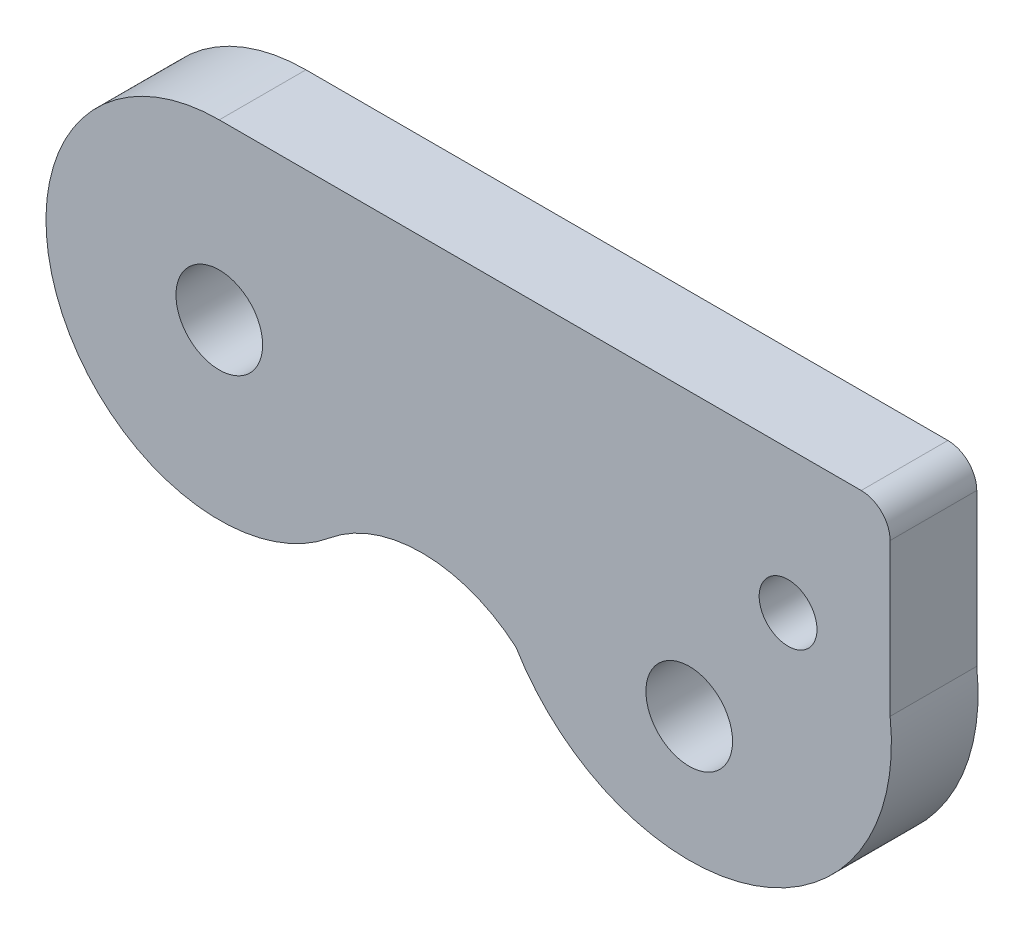
ISO-10303-21;
HEADER;
FILE_DESCRIPTION(('STEP AP214'),'2;1');
FILE_NAME('part.step','',(''),(''),'','','');
FILE_SCHEMA(('AUTOMOTIVE_DESIGN { 1 0 10303 214 1 1 1 1 }'));
ENDSEC;
DATA;
#1=APPLICATION_CONTEXT('core data for automotive mechanical design processes');
#2=APPLICATION_PROTOCOL_DEFINITION('international standard','automotive_design',2000,#1);
#3=PRODUCT_CONTEXT('',#1,'mechanical');
#4=PRODUCT('Part','Part','',(#3));
#5=PRODUCT_RELATED_PRODUCT_CATEGORY('part','',(#4));
#6=PRODUCT_DEFINITION_FORMATION('','',#4);
#7=PRODUCT_DEFINITION_CONTEXT('part definition',#1,'design');
#8=PRODUCT_DEFINITION('design','',#6,#7);
#9=PRODUCT_DEFINITION_SHAPE('','',#8);
#10=(LENGTH_UNIT() NAMED_UNIT(*) SI_UNIT(.MILLI.,.METRE.));
#11=(NAMED_UNIT(*) PLANE_ANGLE_UNIT() SI_UNIT($,.RADIAN.));
#12=(NAMED_UNIT(*) SI_UNIT($,.STERADIAN.) SOLID_ANGLE_UNIT());
#13=UNCERTAINTY_MEASURE_WITH_UNIT(LENGTH_MEASURE(1.E-05),#10,'distance_accuracy_value','');
#14=(GEOMETRIC_REPRESENTATION_CONTEXT(3) GLOBAL_UNCERTAINTY_ASSIGNED_CONTEXT((#13)) GLOBAL_UNIT_ASSIGNED_CONTEXT((#10,
#11,#12)) REPRESENTATION_CONTEXT('',''));
#15=CARTESIAN_POINT('',(0.,0.,0.));
#16=DIRECTION('',(0.,0.,1.));
#17=DIRECTION('',(1.,0.,0.));
#18=AXIS2_PLACEMENT_3D('',#15,#16,#17);
#19=CARTESIAN_POINT('',(0.,-6.,3.));
#20=DIRECTION('',(0.,0.,1.));
#21=DIRECTION('',(1.,0.,0.));
#22=AXIS2_PLACEMENT_3D('',#19,#20,#21);
#23=PLANE('',#22);
#24=CARTESIAN_POINT('',(19.6906458159987,-4.93616233806258,3.));
#25=DIRECTION('',(0.,0.,1.));
#26=DIRECTION('',(1.,0.,0.));
#27=AXIS2_PLACEMENT_3D('',#24,#25,#26);
#28=CIRCLE('',#27,0.999999999999994);
#29=CARTESIAN_POINT('',(20.6906458159987,-4.93616233806258,3.));
#30=VERTEX_POINT('',#29);
#31=EDGE_CURVE('E150',#30,#30,#28,.T.);
#32=ORIENTED_EDGE('',*,*,#31,.F.);
#33=EDGE_LOOP('',(#32));
#34=FACE_BOUND('',#33,.T.);
#35=CARTESIAN_POINT('',(0.,-6.,3.));
#36=DIRECTION('',(0.,0.,1.));
#37=DIRECTION('',(1.,0.,0.));
#38=AXIS2_PLACEMENT_3D('',#35,#36,#37);
#39=CIRCLE('',#38,6.);
#40=CARTESIAN_POINT('',(0.,0.,3.));
#41=VERTEX_POINT('',#40);
#42=CARTESIAN_POINT('',(3.82727225710111,-10.6208210385195,3.));
#43=VERTEX_POINT('',#42);
#44=EDGE_CURVE('E131',#41,#43,#39,.T.);
#45=ORIENTED_EDGE('',*,*,#44,.T.);
#46=CARTESIAN_POINT('',(7.01666580468537,-14.4715052372857,3.));
#47=DIRECTION('',(0.,0.,-1.));
#48=DIRECTION('',(-1.,0.,0.));
#49=AXIS2_PLACEMENT_3D('',#46,#47,#48);
#50=CIRCLE('',#49,5.);
#51=CARTESIAN_POINT('',(10.269229399763,-10.6740284355164,3.));
#52=VERTEX_POINT('',#51);
#53=EDGE_CURVE('E85',#43,#52,#50,.T.);
#54=ORIENTED_EDGE('',*,*,#53,.T.);
#55=CARTESIAN_POINT('',(16.2687627712159,-7.06770075700153,3.));
#56=DIRECTION('',(0.,0.,1.));
#57=DIRECTION('',(1.,0.,0.));
#58=AXIS2_PLACEMENT_3D('',#55,#56,#57);
#59=CIRCLE('',#58,7.);
#60=CARTESIAN_POINT('',(23.2233881055421,-6.2719706148369,3.));
#61=VERTEX_POINT('',#60);
#62=EDGE_CURVE('E99',#52,#61,#59,.T.);
#63=ORIENTED_EDGE('',*,*,#62,.T.);
#64=DIRECTION('',(0.,1.,0.));
#65=VECTOR('',#64,1.);
#66=CARTESIAN_POINT('',(23.2233881055421,-6.2719706148369,3.));
#67=LINE('',#66,#65);
#68=CARTESIAN_POINT('',(23.2233881055421,-1.,3.));
#69=VERTEX_POINT('',#68);
#70=EDGE_CURVE('E92',#61,#69,#67,.T.);
#71=ORIENTED_EDGE('',*,*,#70,.T.);
#72=CARTESIAN_POINT('',(22.2233881055421,-1.,3.));
#73=DIRECTION('',(0.,0.,1.));
#74=DIRECTION('',(1.,0.,0.));
#75=AXIS2_PLACEMENT_3D('',#72,#73,#74);
#76=CIRCLE('',#75,1.);
#77=CARTESIAN_POINT('',(22.2233881055421,0.,3.));
#78=VERTEX_POINT('',#77);
#79=EDGE_CURVE('E96',#69,#78,#76,.T.);
#80=ORIENTED_EDGE('',*,*,#79,.T.);
#81=DIRECTION('',(-1.,0.,0.));
#82=VECTOR('',#81,1.);
#83=CARTESIAN_POINT('',(22.,0.,3.));
#84=LINE('',#83,#82);
#85=EDGE_CURVE('E50',#78,#41,#84,.T.);
#86=ORIENTED_EDGE('',*,*,#85,.T.);
#87=EDGE_LOOP('',(#45,#54,#63,#71,#80,#86));
#88=FACE_BOUND('',#87,.T.);
#89=CARTESIAN_POINT('',(0.,-6.,3.));
#90=DIRECTION('',(0.,0.,1.));
#91=DIRECTION('',(1.,0.,0.));
#92=AXIS2_PLACEMENT_3D('',#89,#90,#91);
#93=CIRCLE('',#92,1.5);
#94=CARTESIAN_POINT('',(1.5,-6.,3.));
#95=VERTEX_POINT('',#94);
#96=EDGE_CURVE('E123',#95,#95,#93,.T.);
#97=ORIENTED_EDGE('',*,*,#96,.F.);
#98=EDGE_LOOP('',(#97));
#99=FACE_BOUND('',#98,.T.);
#100=CARTESIAN_POINT('',(16.2687627712159,-9.74796623904576,3.));
#101=DIRECTION('',(0.,0.,1.));
#102=DIRECTION('',(1.,0.,0.));
#103=AXIS2_PLACEMENT_3D('',#100,#101,#102);
#104=CIRCLE('',#103,1.5);
#105=CARTESIAN_POINT('',(17.7687627712159,-9.74796623904576,3.));
#106=VERTEX_POINT('',#105);
#107=EDGE_CURVE('E156',#106,#106,#104,.T.);
#108=ORIENTED_EDGE('',*,*,#107,.F.);
#109=EDGE_LOOP('',(#108));
#110=FACE_BOUND('',#109,.T.);
#111=ADVANCED_FACE('F33',(#34,#88,#99,#110),#23,.T.);
#112=CARTESIAN_POINT('',(0.,-6.,0.));
#113=DIRECTION('',(0.,0.,1.));
#114=DIRECTION('',(1.,0.,0.));
#115=AXIS2_PLACEMENT_3D('',#112,#113,#114);
#116=PLANE('',#115);
#117=CARTESIAN_POINT('',(0.,-6.,0.));
#118=DIRECTION('',(0.,0.,1.));
#119=DIRECTION('',(1.,0.,0.));
#120=AXIS2_PLACEMENT_3D('',#117,#118,#119);
#121=CIRCLE('',#120,6.);
#122=CARTESIAN_POINT('',(0.,0.,0.));
#123=VERTEX_POINT('',#122);
#124=CARTESIAN_POINT('',(3.82727225710111,-10.6208210385195,0.));
#125=VERTEX_POINT('',#124);
#126=EDGE_CURVE('E119',#123,#125,#121,.T.);
#127=ORIENTED_EDGE('',*,*,#126,.F.);
#128=DIRECTION('',(-1.,0.,0.));
#129=VECTOR('',#128,1.);
#130=CARTESIAN_POINT('',(0.,0.,0.));
#131=LINE('',#130,#129);
#132=CARTESIAN_POINT('',(22.2233881055421,0.,0.));
#133=VERTEX_POINT('',#132);
#134=EDGE_CURVE('E73',#133,#123,#131,.T.);
#135=ORIENTED_EDGE('',*,*,#134,.F.);
#136=CARTESIAN_POINT('',(22.2233881055421,-1.,0.));
#137=DIRECTION('',(0.,0.,1.));
#138=DIRECTION('',(1.,0.,0.));
#139=AXIS2_PLACEMENT_3D('',#136,#137,#138);
#140=CIRCLE('',#139,1.);
#141=CARTESIAN_POINT('',(23.2233881055421,-1.,0.));
#142=VERTEX_POINT('',#141);
#143=EDGE_CURVE('E128',#142,#133,#140,.T.);
#144=ORIENTED_EDGE('',*,*,#143,.F.);
#145=DIRECTION('',(0.,1.,0.));
#146=VECTOR('',#145,1.);
#147=CARTESIAN_POINT('',(23.2233881055421,-6.2719706148369,0.));
#148=LINE('',#147,#146);
#149=CARTESIAN_POINT('',(23.2233881055421,-6.2719706148369,0.));
#150=VERTEX_POINT('',#149);
#151=EDGE_CURVE('E108',#150,#142,#148,.T.);
#152=ORIENTED_EDGE('',*,*,#151,.F.);
#153=CARTESIAN_POINT('',(16.2687627712159,-7.06770075700153,0.));
#154=DIRECTION('',(0.,0.,1.));
#155=DIRECTION('',(1.,0.,0.));
#156=AXIS2_PLACEMENT_3D('',#153,#154,#155);
#157=CIRCLE('',#156,7.);
#158=CARTESIAN_POINT('',(10.269229399763,-10.6740284355164,0.));
#159=VERTEX_POINT('',#158);
#160=EDGE_CURVE('E125',#159,#150,#157,.T.);
#161=ORIENTED_EDGE('',*,*,#160,.F.);
#162=CARTESIAN_POINT('',(7.01666580468537,-14.4715052372857,0.));
#163=DIRECTION('',(0.,0.,-1.));
#164=DIRECTION('',(-1.,0.,0.));
#165=AXIS2_PLACEMENT_3D('',#162,#163,#164);
#166=CIRCLE('',#165,5.);
#167=EDGE_CURVE('E122',#125,#159,#166,.T.);
#168=ORIENTED_EDGE('',*,*,#167,.F.);
#169=EDGE_LOOP('',(#127,#135,#144,#152,#161,#168));
#170=FACE_BOUND('',#169,.T.);
#171=CARTESIAN_POINT('',(0.,-6.,0.));
#172=DIRECTION('',(0.,0.,1.));
#173=DIRECTION('',(1.,0.,0.));
#174=AXIS2_PLACEMENT_3D('',#171,#172,#173);
#175=CIRCLE('',#174,1.5);
#176=CARTESIAN_POINT('',(1.5,-6.,0.));
#177=VERTEX_POINT('',#176);
#178=EDGE_CURVE('E147',#177,#177,#175,.T.);
#179=ORIENTED_EDGE('',*,*,#178,.T.);
#180=EDGE_LOOP('',(#179));
#181=FACE_BOUND('',#180,.T.);
#182=CARTESIAN_POINT('',(19.6906458159987,-4.93616233806258,0.));
#183=DIRECTION('',(0.,0.,1.));
#184=DIRECTION('',(1.,0.,0.));
#185=AXIS2_PLACEMENT_3D('',#182,#183,#184);
#186=CIRCLE('',#185,0.999999999999994);
#187=CARTESIAN_POINT('',(20.6906458159987,-4.93616233806258,0.));
#188=VERTEX_POINT('',#187);
#189=EDGE_CURVE('E153',#188,#188,#186,.T.);
#190=ORIENTED_EDGE('',*,*,#189,.T.);
#191=EDGE_LOOP('',(#190));
#192=FACE_BOUND('',#191,.T.);
#193=CARTESIAN_POINT('',(16.2687627712159,-9.74796623904576,0.));
#194=DIRECTION('',(0.,0.,1.));
#195=DIRECTION('',(1.,0.,0.));
#196=AXIS2_PLACEMENT_3D('',#193,#194,#195);
#197=CIRCLE('',#196,1.5);
#198=CARTESIAN_POINT('',(17.7687627712159,-9.74796623904576,0.));
#199=VERTEX_POINT('',#198);
#200=EDGE_CURVE('E159',#199,#199,#197,.T.);
#201=ORIENTED_EDGE('',*,*,#200,.T.);
#202=EDGE_LOOP('',(#201));
#203=FACE_BOUND('',#202,.T.);
#204=ADVANCED_FACE('F138',(#170,#181,#192,#203),#116,.F.);
#205=CARTESIAN_POINT('',(0.,-6.,3.));
#206=DIRECTION('',(0.,0.,-1.));
#207=DIRECTION('',(-1.,0.,0.));
#208=AXIS2_PLACEMENT_3D('',#205,#206,#207);
#209=CYLINDRICAL_SURFACE('',#208,6.);
#210=ORIENTED_EDGE('',*,*,#126,.T.);
#211=DIRECTION('',(0.,0.,-1.));
#212=VECTOR('',#211,1.);
#213=CARTESIAN_POINT('',(3.82727225710111,-10.6208210385195,3.));
#214=LINE('',#213,#212);
#215=EDGE_CURVE('E11',#43,#125,#214,.T.);
#216=ORIENTED_EDGE('',*,*,#215,.F.);
#217=ORIENTED_EDGE('',*,*,#44,.F.);
#218=DIRECTION('',(0.,0.,-1.));
#219=VECTOR('',#218,1.);
#220=CARTESIAN_POINT('',(0.,0.,3.));
#221=LINE('',#220,#219);
#222=EDGE_CURVE('E115',#41,#123,#221,.T.);
#223=ORIENTED_EDGE('',*,*,#222,.T.);
#224=EDGE_LOOP('',(#210,#216,#217,#223));
#225=FACE_BOUND('',#224,.T.);
#226=ADVANCED_FACE('F35',(#225),#209,.T.);
#227=CARTESIAN_POINT('',(7.01666580468537,-14.4715052372857,3.));
#228=DIRECTION('',(0.,0.,-1.));
#229=DIRECTION('',(-1.,0.,0.));
#230=AXIS2_PLACEMENT_3D('',#227,#228,#229);
#231=CYLINDRICAL_SURFACE('',#230,5.);
#232=ORIENTED_EDGE('',*,*,#167,.T.);
#233=DIRECTION('',(0.,0.,-1.));
#234=VECTOR('',#233,1.);
#235=CARTESIAN_POINT('',(10.269229399763,-10.6740284355164,3.));
#236=LINE('',#235,#234);
#237=EDGE_CURVE('E42',#52,#159,#236,.T.);
#238=ORIENTED_EDGE('',*,*,#237,.F.);
#239=ORIENTED_EDGE('',*,*,#53,.F.);
#240=ORIENTED_EDGE('',*,*,#215,.T.);
#241=EDGE_LOOP('',(#232,#238,#239,#240));
#242=FACE_BOUND('',#241,.T.);
#243=ADVANCED_FACE('F187',(#242),#231,.F.);
#244=CARTESIAN_POINT('',(16.2687627712159,-7.06770075700153,3.));
#245=DIRECTION('',(0.,0.,-1.));
#246=DIRECTION('',(-1.,0.,0.));
#247=AXIS2_PLACEMENT_3D('',#244,#245,#246);
#248=CYLINDRICAL_SURFACE('',#247,7.);
#249=ORIENTED_EDGE('',*,*,#160,.T.);
#250=DIRECTION('',(0.,0.,-1.));
#251=VECTOR('',#250,1.);
#252=CARTESIAN_POINT('',(23.2233881055421,-6.2719706148369,3.));
#253=LINE('',#252,#251);
#254=EDGE_CURVE('E110',#61,#150,#253,.T.);
#255=ORIENTED_EDGE('',*,*,#254,.F.);
#256=ORIENTED_EDGE('',*,*,#62,.F.);
#257=ORIENTED_EDGE('',*,*,#237,.T.);
#258=EDGE_LOOP('',(#249,#255,#256,#257));
#259=FACE_BOUND('',#258,.T.);
#260=ADVANCED_FACE('F137',(#259),#248,.T.);
#261=CARTESIAN_POINT('',(23.2233881055421,-6.2719706148369,3.));
#262=DIRECTION('',(-1.,0.,0.));
#263=DIRECTION('',(0.,0.,1.));
#264=AXIS2_PLACEMENT_3D('',#261,#262,#263);
#265=PLANE('',#264);
#266=ORIENTED_EDGE('',*,*,#151,.T.);
#267=DIRECTION('',(0.,0.,-1.));
#268=VECTOR('',#267,1.);
#269=CARTESIAN_POINT('',(23.2233881055421,-1.,3.));
#270=LINE('',#269,#268);
#271=EDGE_CURVE('E105',#69,#142,#270,.T.);
#272=ORIENTED_EDGE('',*,*,#271,.F.);
#273=ORIENTED_EDGE('',*,*,#70,.F.);
#274=ORIENTED_EDGE('',*,*,#254,.T.);
#275=EDGE_LOOP('',(#266,#272,#273,#274));
#276=FACE_BOUND('',#275,.T.);
#277=ADVANCED_FACE('F106',(#276),#265,.F.);
#278=CARTESIAN_POINT('',(22.2233881055421,-1.,3.));
#279=DIRECTION('',(0.,0.,-1.));
#280=DIRECTION('',(-1.,0.,0.));
#281=AXIS2_PLACEMENT_3D('',#278,#279,#280);
#282=CYLINDRICAL_SURFACE('',#281,1.);
#283=ORIENTED_EDGE('',*,*,#143,.T.);
#284=DIRECTION('',(0.,0.,-1.));
#285=VECTOR('',#284,1.);
#286=CARTESIAN_POINT('',(22.2233881055421,0.,3.));
#287=LINE('',#286,#285);
#288=EDGE_CURVE('E111',#78,#133,#287,.T.);
#289=ORIENTED_EDGE('',*,*,#288,.F.);
#290=ORIENTED_EDGE('',*,*,#79,.F.);
#291=ORIENTED_EDGE('',*,*,#271,.T.);
#292=EDGE_LOOP('',(#283,#289,#290,#291));
#293=FACE_BOUND('',#292,.T.);
#294=ADVANCED_FACE('F113',(#293),#282,.T.);
#295=CARTESIAN_POINT('',(0.,0.,3.));
#296=DIRECTION('',(0.,-1.,0.));
#297=DIRECTION('',(0.,0.,-1.));
#298=AXIS2_PLACEMENT_3D('',#295,#296,#297);
#299=PLANE('',#298);
#300=ORIENTED_EDGE('',*,*,#134,.T.);
#301=ORIENTED_EDGE('',*,*,#222,.F.);
#302=ORIENTED_EDGE('',*,*,#85,.F.);
#303=ORIENTED_EDGE('',*,*,#288,.T.);
#304=EDGE_LOOP('',(#300,#301,#302,#303));
#305=FACE_BOUND('',#304,.T.);
#306=ADVANCED_FACE('F140',(#305),#299,.F.);
#307=CARTESIAN_POINT('',(0.,-6.,3.));
#308=DIRECTION('',(0.,0.,-1.));
#309=DIRECTION('',(-1.,0.,0.));
#310=AXIS2_PLACEMENT_3D('',#307,#308,#309);
#311=CYLINDRICAL_SURFACE('',#310,1.5);
#312=ORIENTED_EDGE('',*,*,#96,.T.);
#313=EDGE_LOOP('',(#312));
#314=FACE_BOUND('',#313,.T.);
#315=ORIENTED_EDGE('',*,*,#178,.F.);
#316=EDGE_LOOP('',(#315));
#317=FACE_BOUND('',#316,.T.);
#318=ADVANCED_FACE('F177',(#314,#317),#311,.F.);
#319=CARTESIAN_POINT('',(19.6906458159987,-4.93616233806258,3.));
#320=DIRECTION('',(0.,0.,-1.));
#321=DIRECTION('',(-1.,0.,0.));
#322=AXIS2_PLACEMENT_3D('',#319,#320,#321);
#323=CYLINDRICAL_SURFACE('',#322,0.999999999999994);
#324=ORIENTED_EDGE('',*,*,#31,.T.);
#325=EDGE_LOOP('',(#324));
#326=FACE_BOUND('',#325,.T.);
#327=ORIENTED_EDGE('',*,*,#189,.F.);
#328=EDGE_LOOP('',(#327));
#329=FACE_BOUND('',#328,.T.);
#330=ADVANCED_FACE('F241',(#326,#329),#323,.F.);
#331=CARTESIAN_POINT('',(16.2687627712159,-9.74796623904576,3.));
#332=DIRECTION('',(0.,0.,-1.));
#333=DIRECTION('',(-1.,0.,0.));
#334=AXIS2_PLACEMENT_3D('',#331,#332,#333);
#335=CYLINDRICAL_SURFACE('',#334,1.5);
#336=ORIENTED_EDGE('',*,*,#107,.T.);
#337=EDGE_LOOP('',(#336));
#338=FACE_BOUND('',#337,.T.);
#339=ORIENTED_EDGE('',*,*,#200,.F.);
#340=EDGE_LOOP('',(#339));
#341=FACE_BOUND('',#340,.T.);
#342=ADVANCED_FACE('F165',(#338,#341),#335,.F.);
#343=CLOSED_SHELL('',(#111,#204,#226,#243,#260,#277,#294,#306,#318,#330,#342));
#344=MANIFOLD_SOLID_BREP('B2',#343);
#345=ADVANCED_BREP_SHAPE_REPRESENTATION('',(#18,#344),#14);
#346=SHAPE_DEFINITION_REPRESENTATION(#9,#345);
ENDSEC;
END-ISO-10303-21;
